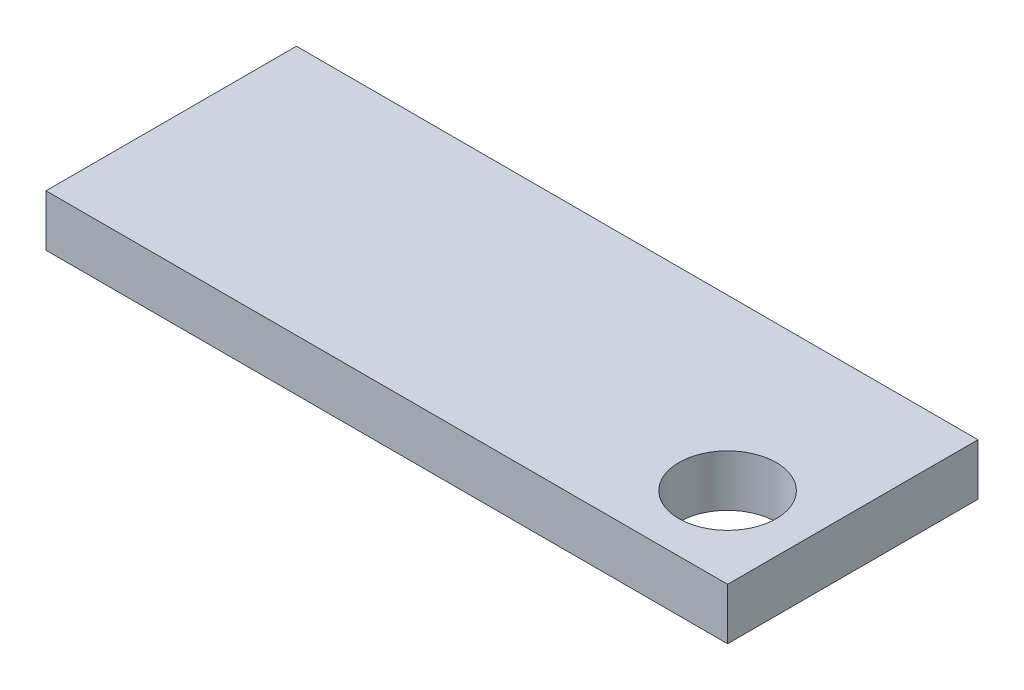
ISO-10303-21;
HEADER;
FILE_DESCRIPTION(('STEP AP214'),'2;1');
FILE_NAME('part.step','',(''),(''),'','','');
FILE_SCHEMA(('AUTOMOTIVE_DESIGN { 1 0 10303 214 1 1 1 1 }'));
ENDSEC;
DATA;
#1=APPLICATION_CONTEXT('core data for automotive mechanical design processes');
#2=APPLICATION_PROTOCOL_DEFINITION('international standard','automotive_design',2000,#1);
#3=PRODUCT_CONTEXT('',#1,'mechanical');
#4=PRODUCT('Part','Part','',(#3));
#5=PRODUCT_RELATED_PRODUCT_CATEGORY('part','',(#4));
#6=PRODUCT_DEFINITION_FORMATION('','',#4);
#7=PRODUCT_DEFINITION_CONTEXT('part definition',#1,'design');
#8=PRODUCT_DEFINITION('design','',#6,#7);
#9=PRODUCT_DEFINITION_SHAPE('','',#8);
#10=(LENGTH_UNIT() NAMED_UNIT(*) SI_UNIT(.MILLI.,.METRE.));
#11=(NAMED_UNIT(*) PLANE_ANGLE_UNIT() SI_UNIT($,.RADIAN.));
#12=(NAMED_UNIT(*) SI_UNIT($,.STERADIAN.) SOLID_ANGLE_UNIT());
#13=UNCERTAINTY_MEASURE_WITH_UNIT(LENGTH_MEASURE(1.E-05),#10,'distance_accuracy_value','');
#14=(GEOMETRIC_REPRESENTATION_CONTEXT(3) GLOBAL_UNCERTAINTY_ASSIGNED_CONTEXT((#13)) GLOBAL_UNIT_ASSIGNED_CONTEXT((#10,
#11,#12)) REPRESENTATION_CONTEXT('',''));
#15=CARTESIAN_POINT('',(0.,0.,0.));
#16=DIRECTION('',(0.,0.,1.));
#17=DIRECTION('',(1.,0.,0.));
#18=AXIS2_PLACEMENT_3D('',#15,#16,#17);
#19=CARTESIAN_POINT('',(0.,1.5875,0.));
#20=DIRECTION('',(0.,-1.,0.));
#21=DIRECTION('',(0.,0.,-1.));
#22=AXIS2_PLACEMENT_3D('',#19,#20,#21);
#23=PLANE('',#22);
#24=DIRECTION('',(0.,0.,1.));
#25=VECTOR('',#24,1.);
#26=CARTESIAN_POINT('',(0.,1.5875,0.));
#27=LINE('',#26,#25);
#28=CARTESIAN_POINT('',(0.,1.5875,-15.43));
#29=VERTEX_POINT('',#28);
#30=CARTESIAN_POINT('',(0.,1.5875,0.));
#31=VERTEX_POINT('',#30);
#32=EDGE_CURVE('E90',#29,#31,#27,.T.);
#33=ORIENTED_EDGE('',*,*,#32,.T.);
#34=DIRECTION('',(1.,0.,0.));
#35=VECTOR('',#34,1.);
#36=CARTESIAN_POINT('',(0.,1.5875,0.));
#37=LINE('',#36,#35);
#38=CARTESIAN_POINT('',(42.,1.5875,0.));
#39=VERTEX_POINT('',#38);
#40=EDGE_CURVE('E85',#31,#39,#37,.T.);
#41=ORIENTED_EDGE('',*,*,#40,.T.);
#42=DIRECTION('',(0.,0.,-1.));
#43=VECTOR('',#42,1.);
#44=CARTESIAN_POINT('',(42.,1.5875,0.));
#45=LINE('',#44,#43);
#46=CARTESIAN_POINT('',(42.,1.5875,-15.43));
#47=VERTEX_POINT('',#46);
#48=EDGE_CURVE('E88',#39,#47,#45,.T.);
#49=ORIENTED_EDGE('',*,*,#48,.T.);
#50=DIRECTION('',(-1.,0.,0.));
#51=VECTOR('',#50,1.);
#52=CARTESIAN_POINT('',(0.,1.5875,-15.43));
#53=LINE('',#52,#51);
#54=EDGE_CURVE('E55',#47,#29,#53,.T.);
#55=ORIENTED_EDGE('',*,*,#54,.T.);
#56=EDGE_LOOP('',(#33,#41,#49,#55));
#57=FACE_BOUND('',#56,.T.);
#58=CARTESIAN_POINT('',(37.,1.5875,-5.));
#59=DIRECTION('',(0.,1.,0.));
#60=DIRECTION('',(0.,0.,1.));
#61=AXIS2_PLACEMENT_3D('',#58,#59,#60);
#62=CIRCLE('',#61,3.);
#63=CARTESIAN_POINT('',(37.,1.5875,-2.));
#64=VERTEX_POINT('',#63);
#65=EDGE_CURVE('E118',#64,#64,#62,.T.);
#66=ORIENTED_EDGE('',*,*,#65,.F.);
#67=EDGE_LOOP('',(#66));
#68=FACE_BOUND('',#67,.T.);
#69=ADVANCED_FACE('F38',(#57,#68),#23,.F.);
#70=CARTESIAN_POINT('',(0.,1.5875,0.));
#71=DIRECTION('',(1.,0.,0.));
#72=DIRECTION('',(0.,0.,-1.));
#73=AXIS2_PLACEMENT_3D('',#70,#71,#72);
#74=PLANE('',#73);
#75=DIRECTION('',(0.,0.,1.));
#76=VECTOR('',#75,1.);
#77=CARTESIAN_POINT('',(0.,-1.5875,0.));
#78=LINE('',#77,#76);
#79=CARTESIAN_POINT('',(0.,-1.5875,-15.43));
#80=VERTEX_POINT('',#79);
#81=CARTESIAN_POINT('',(0.,-1.5875,0.));
#82=VERTEX_POINT('',#81);
#83=EDGE_CURVE('E102',#80,#82,#78,.T.);
#84=ORIENTED_EDGE('',*,*,#83,.T.);
#85=DIRECTION('',(0.,-1.,0.));
#86=VECTOR('',#85,1.);
#87=CARTESIAN_POINT('',(0.,1.5875,0.));
#88=LINE('',#87,#86);
#89=EDGE_CURVE('E11',#31,#82,#88,.T.);
#90=ORIENTED_EDGE('',*,*,#89,.F.);
#91=ORIENTED_EDGE('',*,*,#32,.F.);
#92=DIRECTION('',(0.,-1.,0.));
#93=VECTOR('',#92,1.);
#94=CARTESIAN_POINT('',(0.,1.5875,-15.43));
#95=LINE('',#94,#93);
#96=EDGE_CURVE('E98',#29,#80,#95,.T.);
#97=ORIENTED_EDGE('',*,*,#96,.T.);
#98=EDGE_LOOP('',(#84,#90,#91,#97));
#99=FACE_BOUND('',#98,.T.);
#100=ADVANCED_FACE('F40',(#99),#74,.F.);
#101=CARTESIAN_POINT('',(0.,1.5875,0.));
#102=DIRECTION('',(0.,0.,-1.));
#103=DIRECTION('',(-1.,0.,0.));
#104=AXIS2_PLACEMENT_3D('',#101,#102,#103);
#105=PLANE('',#104);
#106=DIRECTION('',(1.,0.,0.));
#107=VECTOR('',#106,1.);
#108=CARTESIAN_POINT('',(0.,-1.5875,0.));
#109=LINE('',#108,#107);
#110=CARTESIAN_POINT('',(42.,-1.5875,0.));
#111=VERTEX_POINT('',#110);
#112=EDGE_CURVE('E94',#82,#111,#109,.T.);
#113=ORIENTED_EDGE('',*,*,#112,.T.);
#114=DIRECTION('',(0.,-1.,0.));
#115=VECTOR('',#114,1.);
#116=CARTESIAN_POINT('',(42.,1.5875,0.));
#117=LINE('',#116,#115);
#118=EDGE_CURVE('E47',#39,#111,#117,.T.);
#119=ORIENTED_EDGE('',*,*,#118,.F.);
#120=ORIENTED_EDGE('',*,*,#40,.F.);
#121=ORIENTED_EDGE('',*,*,#89,.T.);
#122=EDGE_LOOP('',(#113,#119,#120,#121));
#123=FACE_BOUND('',#122,.T.);
#124=ADVANCED_FACE('F93',(#123),#105,.F.);
#125=CARTESIAN_POINT('',(42.,1.5875,0.));
#126=DIRECTION('',(-1.,0.,0.));
#127=DIRECTION('',(0.,0.,1.));
#128=AXIS2_PLACEMENT_3D('',#125,#126,#127);
#129=PLANE('',#128);
#130=DIRECTION('',(0.,0.,-1.));
#131=VECTOR('',#130,1.);
#132=CARTESIAN_POINT('',(42.,-1.5875,0.));
#133=LINE('',#132,#131);
#134=CARTESIAN_POINT('',(42.,-1.5875,-15.43));
#135=VERTEX_POINT('',#134);
#136=EDGE_CURVE('E72',#111,#135,#133,.T.);
#137=ORIENTED_EDGE('',*,*,#136,.T.);
#138=DIRECTION('',(0.,-1.,0.));
#139=VECTOR('',#138,1.);
#140=CARTESIAN_POINT('',(42.,1.5875,-15.43));
#141=LINE('',#140,#139);
#142=EDGE_CURVE('E95',#47,#135,#141,.T.);
#143=ORIENTED_EDGE('',*,*,#142,.F.);
#144=ORIENTED_EDGE('',*,*,#48,.F.);
#145=ORIENTED_EDGE('',*,*,#118,.T.);
#146=EDGE_LOOP('',(#137,#143,#144,#145));
#147=FACE_BOUND('',#146,.T.);
#148=ADVANCED_FACE('F96',(#147),#129,.F.);
#149=CARTESIAN_POINT('',(0.,1.5875,-15.43));
#150=DIRECTION('',(0.,0.,1.));
#151=DIRECTION('',(1.,0.,0.));
#152=AXIS2_PLACEMENT_3D('',#149,#150,#151);
#153=PLANE('',#152);
#154=DIRECTION('',(-1.,0.,0.));
#155=VECTOR('',#154,1.);
#156=CARTESIAN_POINT('',(0.,-1.5875,-15.43));
#157=LINE('',#156,#155);
#158=EDGE_CURVE('E78',#135,#80,#157,.T.);
#159=ORIENTED_EDGE('',*,*,#158,.T.);
#160=ORIENTED_EDGE('',*,*,#96,.F.);
#161=ORIENTED_EDGE('',*,*,#54,.F.);
#162=ORIENTED_EDGE('',*,*,#142,.T.);
#163=EDGE_LOOP('',(#159,#160,#161,#162));
#164=FACE_BOUND('',#163,.T.);
#165=ADVANCED_FACE('F110',(#164),#153,.F.);
#166=CARTESIAN_POINT('',(0.,-1.5875,0.));
#167=DIRECTION('',(0.,-1.,0.));
#168=DIRECTION('',(0.,0.,-1.));
#169=AXIS2_PLACEMENT_3D('',#166,#167,#168);
#170=PLANE('',#169);
#171=CARTESIAN_POINT('',(37.,-1.5875,-5.));
#172=DIRECTION('',(0.,1.,0.));
#173=DIRECTION('',(0.,0.,1.));
#174=AXIS2_PLACEMENT_3D('',#171,#172,#173);
#175=CIRCLE('',#174,3.);
#176=CARTESIAN_POINT('',(37.,-1.5875,-2.));
#177=VERTEX_POINT('',#176);
#178=EDGE_CURVE('E105',#177,#177,#175,.T.);
#179=ORIENTED_EDGE('',*,*,#178,.T.);
#180=EDGE_LOOP('',(#179));
#181=FACE_BOUND('',#180,.T.);
#182=ORIENTED_EDGE('',*,*,#83,.F.);
#183=ORIENTED_EDGE('',*,*,#158,.F.);
#184=ORIENTED_EDGE('',*,*,#136,.F.);
#185=ORIENTED_EDGE('',*,*,#112,.F.);
#186=EDGE_LOOP('',(#182,#183,#184,#185));
#187=FACE_BOUND('',#186,.T.);
#188=ADVANCED_FACE('F113',(#181,#187),#170,.T.);
#189=CARTESIAN_POINT('',(37.,1.5875,-5.));
#190=DIRECTION('',(0.,1.,0.));
#191=DIRECTION('',(0.,0.,1.));
#192=AXIS2_PLACEMENT_3D('',#189,#190,#191);
#193=CYLINDRICAL_SURFACE('',#192,3.);
#194=ORIENTED_EDGE('',*,*,#178,.F.);
#195=EDGE_LOOP('',(#194));
#196=FACE_BOUND('',#195,.T.);
#197=ORIENTED_EDGE('',*,*,#65,.T.);
#198=EDGE_LOOP('',(#197));
#199=FACE_BOUND('',#198,.T.);
#200=ADVANCED_FACE('F122',(#196,#199),#193,.F.);
#201=CLOSED_SHELL('',(#69,#100,#124,#148,#165,#188,#200));
#202=MANIFOLD_SOLID_BREP('B2',#201);
#203=ADVANCED_BREP_SHAPE_REPRESENTATION('',(#18,#202),#14);
#204=SHAPE_DEFINITION_REPRESENTATION(#9,#203);
ENDSEC;
END-ISO-10303-21;
